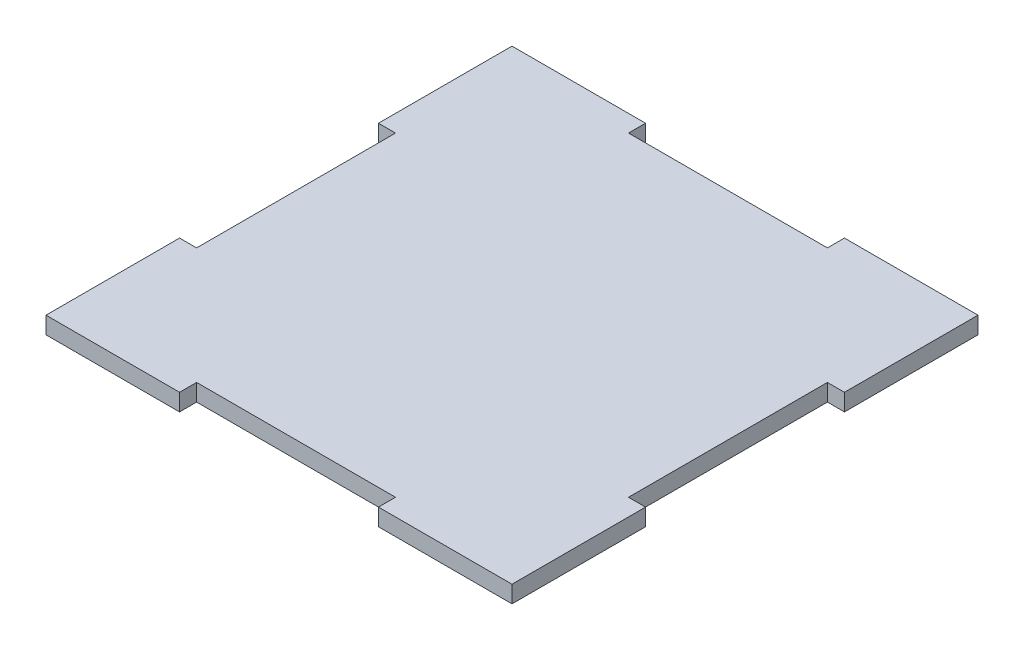
ISO-10303-21;
HEADER;
FILE_DESCRIPTION(('STEP AP214'),'2;1');
FILE_NAME('part.step','',(''),(''),'','','');
FILE_SCHEMA(('AUTOMOTIVE_DESIGN { 1 0 10303 214 1 1 1 1 }'));
ENDSEC;
DATA;
#1=APPLICATION_CONTEXT('core data for automotive mechanical design processes');
#2=APPLICATION_PROTOCOL_DEFINITION('international standard','automotive_design',2000,#1);
#3=PRODUCT_CONTEXT('',#1,'mechanical');
#4=PRODUCT('Part','Part','',(#3));
#5=PRODUCT_RELATED_PRODUCT_CATEGORY('part','',(#4));
#6=PRODUCT_DEFINITION_FORMATION('','',#4);
#7=PRODUCT_DEFINITION_CONTEXT('part definition',#1,'design');
#8=PRODUCT_DEFINITION('design','',#6,#7);
#9=PRODUCT_DEFINITION_SHAPE('','',#8);
#10=(LENGTH_UNIT() NAMED_UNIT(*) SI_UNIT(.MILLI.,.METRE.));
#11=(NAMED_UNIT(*) PLANE_ANGLE_UNIT() SI_UNIT($,.RADIAN.));
#12=(NAMED_UNIT(*) SI_UNIT($,.STERADIAN.) SOLID_ANGLE_UNIT());
#13=UNCERTAINTY_MEASURE_WITH_UNIT(LENGTH_MEASURE(1.E-05),#10,'distance_accuracy_value','');
#14=(GEOMETRIC_REPRESENTATION_CONTEXT(3) GLOBAL_UNCERTAINTY_ASSIGNED_CONTEXT((#13)) GLOBAL_UNIT_ASSIGNED_CONTEXT((#10,
#11,#12)) REPRESENTATION_CONTEXT('',''));
#15=CARTESIAN_POINT('',(0.,0.,0.));
#16=DIRECTION('',(0.,0.,1.));
#17=DIRECTION('',(1.,0.,0.));
#18=AXIS2_PLACEMENT_3D('',#15,#16,#17);
#19=CARTESIAN_POINT('',(41.,3.,-17.5));
#20=DIRECTION('',(-1.,0.,0.));
#21=DIRECTION('',(0.,0.,1.));
#22=AXIS2_PLACEMENT_3D('',#19,#20,#21);
#23=PLANE('',#22);
#24=DIRECTION('',(0.,0.,-1.));
#25=VECTOR('',#24,1.);
#26=CARTESIAN_POINT('',(41.,0.,-17.5));
#27=LINE('',#26,#25);
#28=CARTESIAN_POINT('',(41.,0.,-17.5));
#29=VERTEX_POINT('',#28);
#30=CARTESIAN_POINT('',(41.,0.,-41.));
#31=VERTEX_POINT('',#30);
#32=EDGE_CURVE('E205',#29,#31,#27,.T.);
#33=ORIENTED_EDGE('',*,*,#32,.T.);
#34=DIRECTION('',(0.,-1.,0.));
#35=VECTOR('',#34,1.);
#36=CARTESIAN_POINT('',(41.,3.,-41.));
#37=LINE('',#36,#35);
#38=CARTESIAN_POINT('',(41.,3.,-41.));
#39=VERTEX_POINT('',#38);
#40=EDGE_CURVE('E11',#39,#31,#37,.T.);
#41=ORIENTED_EDGE('',*,*,#40,.F.);
#42=DIRECTION('',(0.,0.,-1.));
#43=VECTOR('',#42,1.);
#44=CARTESIAN_POINT('',(41.,3.,-17.5));
#45=LINE('',#44,#43);
#46=CARTESIAN_POINT('',(41.,3.,-17.5));
#47=VERTEX_POINT('',#46);
#48=EDGE_CURVE('E243',#47,#39,#45,.T.);
#49=ORIENTED_EDGE('',*,*,#48,.F.);
#50=DIRECTION('',(0.,-1.,0.));
#51=VECTOR('',#50,1.);
#52=CARTESIAN_POINT('',(41.,3.,-17.5));
#53=LINE('',#52,#51);
#54=EDGE_CURVE('E201',#47,#29,#53,.T.);
#55=ORIENTED_EDGE('',*,*,#54,.T.);
#56=EDGE_LOOP('',(#33,#41,#49,#55));
#57=FACE_BOUND('',#56,.T.);
#58=ADVANCED_FACE('F37',(#57),#23,.F.);
#59=CARTESIAN_POINT('',(17.5,3.,-41.));
#60=DIRECTION('',(0.,0.,1.));
#61=DIRECTION('',(1.,0.,0.));
#62=AXIS2_PLACEMENT_3D('',#59,#60,#61);
#63=PLANE('',#62);
#64=DIRECTION('',(-1.,0.,0.));
#65=VECTOR('',#64,1.);
#66=CARTESIAN_POINT('',(17.5,0.,-41.));
#67=LINE('',#66,#65);
#68=CARTESIAN_POINT('',(17.5,0.,-41.));
#69=VERTEX_POINT('',#68);
#70=EDGE_CURVE('E208',#31,#69,#67,.T.);
#71=ORIENTED_EDGE('',*,*,#70,.T.);
#72=DIRECTION('',(0.,-1.,0.));
#73=VECTOR('',#72,1.);
#74=CARTESIAN_POINT('',(17.5,3.,-41.));
#75=LINE('',#74,#73);
#76=CARTESIAN_POINT('',(17.5,3.,-41.));
#77=VERTEX_POINT('',#76);
#78=EDGE_CURVE('E45',#77,#69,#75,.T.);
#79=ORIENTED_EDGE('',*,*,#78,.F.);
#80=DIRECTION('',(-1.,0.,0.));
#81=VECTOR('',#80,1.);
#82=CARTESIAN_POINT('',(17.5,3.,-41.));
#83=LINE('',#82,#81);
#84=EDGE_CURVE('E132',#39,#77,#83,.T.);
#85=ORIENTED_EDGE('',*,*,#84,.F.);
#86=ORIENTED_EDGE('',*,*,#40,.T.);
#87=EDGE_LOOP('',(#71,#79,#85,#86));
#88=FACE_BOUND('',#87,.T.);
#89=ADVANCED_FACE('F361',(#88),#63,.F.);
#90=CARTESIAN_POINT('',(17.5,3.,-38.));
#91=DIRECTION('',(1.,0.,0.));
#92=DIRECTION('',(0.,0.,-1.));
#93=AXIS2_PLACEMENT_3D('',#90,#91,#92);
#94=PLANE('',#93);
#95=DIRECTION('',(0.,0.,1.));
#96=VECTOR('',#95,1.);
#97=CARTESIAN_POINT('',(17.5,0.,-38.));
#98=LINE('',#97,#96);
#99=CARTESIAN_POINT('',(17.5,0.,-38.));
#100=VERTEX_POINT('',#99);
#101=EDGE_CURVE('E210',#69,#100,#98,.T.);
#102=ORIENTED_EDGE('',*,*,#101,.T.);
#103=DIRECTION('',(0.,-1.,0.));
#104=VECTOR('',#103,1.);
#105=CARTESIAN_POINT('',(17.5,3.,-38.));
#106=LINE('',#105,#104);
#107=CARTESIAN_POINT('',(17.5,3.,-38.));
#108=VERTEX_POINT('',#107);
#109=EDGE_CURVE('E286',#108,#100,#106,.T.);
#110=ORIENTED_EDGE('',*,*,#109,.F.);
#111=DIRECTION('',(0.,0.,1.));
#112=VECTOR('',#111,1.);
#113=CARTESIAN_POINT('',(17.5,3.,-38.));
#114=LINE('',#113,#112);
#115=EDGE_CURVE('E294',#77,#108,#114,.T.);
#116=ORIENTED_EDGE('',*,*,#115,.F.);
#117=ORIENTED_EDGE('',*,*,#78,.T.);
#118=EDGE_LOOP('',(#102,#110,#116,#117));
#119=FACE_BOUND('',#118,.T.);
#120=ADVANCED_FACE('F292',(#119),#94,.F.);
#121=CARTESIAN_POINT('',(-17.5,3.,-38.));
#122=DIRECTION('',(0.,0.,1.));
#123=DIRECTION('',(1.,0.,0.));
#124=AXIS2_PLACEMENT_3D('',#121,#122,#123);
#125=PLANE('',#124);
#126=DIRECTION('',(-1.,0.,0.));
#127=VECTOR('',#126,1.);
#128=CARTESIAN_POINT('',(-17.5,0.,-38.));
#129=LINE('',#128,#127);
#130=CARTESIAN_POINT('',(-17.5,0.,-38.));
#131=VERTEX_POINT('',#130);
#132=EDGE_CURVE('E212',#100,#131,#129,.T.);
#133=ORIENTED_EDGE('',*,*,#132,.T.);
#134=DIRECTION('',(0.,-1.,0.));
#135=VECTOR('',#134,1.);
#136=CARTESIAN_POINT('',(-17.5,3.,-38.));
#137=LINE('',#136,#135);
#138=CARTESIAN_POINT('',(-17.5,3.,-38.));
#139=VERTEX_POINT('',#138);
#140=EDGE_CURVE('E283',#139,#131,#137,.T.);
#141=ORIENTED_EDGE('',*,*,#140,.F.);
#142=DIRECTION('',(-1.,0.,0.));
#143=VECTOR('',#142,1.);
#144=CARTESIAN_POINT('',(-17.5,3.,-38.));
#145=LINE('',#144,#143);
#146=EDGE_CURVE('E312',#108,#139,#145,.T.);
#147=ORIENTED_EDGE('',*,*,#146,.F.);
#148=ORIENTED_EDGE('',*,*,#109,.T.);
#149=EDGE_LOOP('',(#133,#141,#147,#148));
#150=FACE_BOUND('',#149,.T.);
#151=ADVANCED_FACE('F303',(#150),#125,.F.);
#152=CARTESIAN_POINT('',(-17.5,3.,-41.));
#153=DIRECTION('',(-1.,0.,0.));
#154=DIRECTION('',(0.,0.,1.));
#155=AXIS2_PLACEMENT_3D('',#152,#153,#154);
#156=PLANE('',#155);
#157=DIRECTION('',(0.,0.,-1.));
#158=VECTOR('',#157,1.);
#159=CARTESIAN_POINT('',(-17.5,0.,-41.));
#160=LINE('',#159,#158);
#161=CARTESIAN_POINT('',(-17.5,0.,-41.));
#162=VERTEX_POINT('',#161);
#163=EDGE_CURVE('E214',#131,#162,#160,.T.);
#164=ORIENTED_EDGE('',*,*,#163,.T.);
#165=DIRECTION('',(0.,-1.,0.));
#166=VECTOR('',#165,1.);
#167=CARTESIAN_POINT('',(-17.5,3.,-41.));
#168=LINE('',#167,#166);
#169=CARTESIAN_POINT('',(-17.5,3.,-41.));
#170=VERTEX_POINT('',#169);
#171=EDGE_CURVE('E280',#170,#162,#168,.T.);
#172=ORIENTED_EDGE('',*,*,#171,.F.);
#173=DIRECTION('',(0.,0.,-1.));
#174=VECTOR('',#173,1.);
#175=CARTESIAN_POINT('',(-17.5,3.,-41.));
#176=LINE('',#175,#174);
#177=EDGE_CURVE('E309',#139,#170,#176,.T.);
#178=ORIENTED_EDGE('',*,*,#177,.F.);
#179=ORIENTED_EDGE('',*,*,#140,.T.);
#180=EDGE_LOOP('',(#164,#172,#178,#179));
#181=FACE_BOUND('',#180,.T.);
#182=ADVANCED_FACE('F307',(#181),#156,.F.);
#183=CARTESIAN_POINT('',(-41.,3.,-41.));
#184=DIRECTION('',(0.,0.,1.));
#185=DIRECTION('',(1.,0.,0.));
#186=AXIS2_PLACEMENT_3D('',#183,#184,#185);
#187=PLANE('',#186);
#188=DIRECTION('',(-1.,0.,0.));
#189=VECTOR('',#188,1.);
#190=CARTESIAN_POINT('',(-41.,0.,-41.));
#191=LINE('',#190,#189);
#192=CARTESIAN_POINT('',(-41.,0.,-41.));
#193=VERTEX_POINT('',#192);
#194=EDGE_CURVE('E216',#162,#193,#191,.T.);
#195=ORIENTED_EDGE('',*,*,#194,.T.);
#196=DIRECTION('',(0.,-1.,0.));
#197=VECTOR('',#196,1.);
#198=CARTESIAN_POINT('',(-41.,3.,-41.));
#199=LINE('',#198,#197);
#200=CARTESIAN_POINT('',(-41.,3.,-41.));
#201=VERTEX_POINT('',#200);
#202=EDGE_CURVE('E277',#201,#193,#199,.T.);
#203=ORIENTED_EDGE('',*,*,#202,.F.);
#204=DIRECTION('',(-1.,0.,0.));
#205=VECTOR('',#204,1.);
#206=CARTESIAN_POINT('',(-41.,3.,-41.));
#207=LINE('',#206,#205);
#208=EDGE_CURVE('E311',#170,#201,#207,.T.);
#209=ORIENTED_EDGE('',*,*,#208,.F.);
#210=ORIENTED_EDGE('',*,*,#171,.T.);
#211=EDGE_LOOP('',(#195,#203,#209,#210));
#212=FACE_BOUND('',#211,.T.);
#213=ADVANCED_FACE('F374',(#212),#187,.F.);
#214=CARTESIAN_POINT('',(-41.,3.,-17.5));
#215=DIRECTION('',(1.,0.,0.));
#216=DIRECTION('',(0.,0.,-1.));
#217=AXIS2_PLACEMENT_3D('',#214,#215,#216);
#218=PLANE('',#217);
#219=DIRECTION('',(0.,0.,1.));
#220=VECTOR('',#219,1.);
#221=CARTESIAN_POINT('',(-41.,0.,-17.5));
#222=LINE('',#221,#220);
#223=CARTESIAN_POINT('',(-41.,0.,-17.5));
#224=VERTEX_POINT('',#223);
#225=EDGE_CURVE('E218',#193,#224,#222,.T.);
#226=ORIENTED_EDGE('',*,*,#225,.T.);
#227=DIRECTION('',(0.,-1.,0.));
#228=VECTOR('',#227,1.);
#229=CARTESIAN_POINT('',(-41.,3.,-17.5));
#230=LINE('',#229,#228);
#231=CARTESIAN_POINT('',(-41.,3.,-17.5));
#232=VERTEX_POINT('',#231);
#233=EDGE_CURVE('E274',#232,#224,#230,.T.);
#234=ORIENTED_EDGE('',*,*,#233,.F.);
#235=DIRECTION('',(0.,0.,1.));
#236=VECTOR('',#235,1.);
#237=CARTESIAN_POINT('',(-41.,3.,-17.5));
#238=LINE('',#237,#236);
#239=EDGE_CURVE('E314',#201,#232,#238,.T.);
#240=ORIENTED_EDGE('',*,*,#239,.F.);
#241=ORIENTED_EDGE('',*,*,#202,.T.);
#242=EDGE_LOOP('',(#226,#234,#240,#241));
#243=FACE_BOUND('',#242,.T.);
#244=ADVANCED_FACE('F377',(#243),#218,.F.);
#245=CARTESIAN_POINT('',(-41.,3.,-17.5));
#246=DIRECTION('',(0.,0.,-1.));
#247=DIRECTION('',(-1.,0.,0.));
#248=AXIS2_PLACEMENT_3D('',#245,#246,#247);
#249=PLANE('',#248);
#250=DIRECTION('',(1.,0.,0.));
#251=VECTOR('',#250,1.);
#252=CARTESIAN_POINT('',(-41.,0.,-17.5));
#253=LINE('',#252,#251);
#254=CARTESIAN_POINT('',(-38.,0.,-17.5));
#255=VERTEX_POINT('',#254);
#256=EDGE_CURVE('E220',#224,#255,#253,.T.);
#257=ORIENTED_EDGE('',*,*,#256,.T.);
#258=DIRECTION('',(0.,-1.,0.));
#259=VECTOR('',#258,1.);
#260=CARTESIAN_POINT('',(-38.,3.,-17.5));
#261=LINE('',#260,#259);
#262=CARTESIAN_POINT('',(-38.,3.,-17.5));
#263=VERTEX_POINT('',#262);
#264=EDGE_CURVE('E271',#263,#255,#261,.T.);
#265=ORIENTED_EDGE('',*,*,#264,.F.);
#266=DIRECTION('',(1.,0.,0.));
#267=VECTOR('',#266,1.);
#268=CARTESIAN_POINT('',(-41.,3.,-17.5));
#269=LINE('',#268,#267);
#270=EDGE_CURVE('E320',#232,#263,#269,.T.);
#271=ORIENTED_EDGE('',*,*,#270,.F.);
#272=ORIENTED_EDGE('',*,*,#233,.T.);
#273=EDGE_LOOP('',(#257,#265,#271,#272));
#274=FACE_BOUND('',#273,.T.);
#275=ADVANCED_FACE('F381',(#274),#249,.F.);
#276=CARTESIAN_POINT('',(-38.,3.,-17.5));
#277=DIRECTION('',(1.,0.,0.));
#278=DIRECTION('',(0.,0.,-1.));
#279=AXIS2_PLACEMENT_3D('',#276,#277,#278);
#280=PLANE('',#279);
#281=DIRECTION('',(0.,0.,1.));
#282=VECTOR('',#281,1.);
#283=CARTESIAN_POINT('',(-38.,0.,-17.5));
#284=LINE('',#283,#282);
#285=CARTESIAN_POINT('',(-38.,0.,17.5));
#286=VERTEX_POINT('',#285);
#287=EDGE_CURVE('E222',#255,#286,#284,.T.);
#288=ORIENTED_EDGE('',*,*,#287,.T.);
#289=DIRECTION('',(0.,-1.,0.));
#290=VECTOR('',#289,1.);
#291=CARTESIAN_POINT('',(-38.,3.,17.5));
#292=LINE('',#291,#290);
#293=CARTESIAN_POINT('',(-38.,3.,17.5));
#294=VERTEX_POINT('',#293);
#295=EDGE_CURVE('E268',#294,#286,#292,.T.);
#296=ORIENTED_EDGE('',*,*,#295,.F.);
#297=DIRECTION('',(0.,0.,1.));
#298=VECTOR('',#297,1.);
#299=CARTESIAN_POINT('',(-38.,3.,-17.5));
#300=LINE('',#299,#298);
#301=EDGE_CURVE('E322',#263,#294,#300,.T.);
#302=ORIENTED_EDGE('',*,*,#301,.F.);
#303=ORIENTED_EDGE('',*,*,#264,.T.);
#304=EDGE_LOOP('',(#288,#296,#302,#303));
#305=FACE_BOUND('',#304,.T.);
#306=ADVANCED_FACE('F385',(#305),#280,.F.);
#307=CARTESIAN_POINT('',(-38.,3.,17.5));
#308=DIRECTION('',(0.,0.,1.));
#309=DIRECTION('',(1.,0.,0.));
#310=AXIS2_PLACEMENT_3D('',#307,#308,#309);
#311=PLANE('',#310);
#312=DIRECTION('',(-1.,0.,0.));
#313=VECTOR('',#312,1.);
#314=CARTESIAN_POINT('',(-38.,0.,17.5));
#315=LINE('',#314,#313);
#316=CARTESIAN_POINT('',(-41.,0.,17.5));
#317=VERTEX_POINT('',#316);
#318=EDGE_CURVE('E224',#286,#317,#315,.T.);
#319=ORIENTED_EDGE('',*,*,#318,.T.);
#320=DIRECTION('',(0.,-1.,0.));
#321=VECTOR('',#320,1.);
#322=CARTESIAN_POINT('',(-41.,3.,17.5));
#323=LINE('',#322,#321);
#324=CARTESIAN_POINT('',(-41.,3.,17.5));
#325=VERTEX_POINT('',#324);
#326=EDGE_CURVE('E265',#325,#317,#323,.T.);
#327=ORIENTED_EDGE('',*,*,#326,.F.);
#328=DIRECTION('',(-1.,0.,0.));
#329=VECTOR('',#328,1.);
#330=CARTESIAN_POINT('',(-38.,3.,17.5));
#331=LINE('',#330,#329);
#332=EDGE_CURVE('E324',#294,#325,#331,.T.);
#333=ORIENTED_EDGE('',*,*,#332,.F.);
#334=ORIENTED_EDGE('',*,*,#295,.T.);
#335=EDGE_LOOP('',(#319,#327,#333,#334));
#336=FACE_BOUND('',#335,.T.);
#337=ADVANCED_FACE('F389',(#336),#311,.F.);
#338=CARTESIAN_POINT('',(-41.,3.,41.));
#339=DIRECTION('',(1.,0.,0.));
#340=DIRECTION('',(0.,0.,-1.));
#341=AXIS2_PLACEMENT_3D('',#338,#339,#340);
#342=PLANE('',#341);
#343=DIRECTION('',(0.,0.,1.));
#344=VECTOR('',#343,1.);
#345=CARTESIAN_POINT('',(-41.,0.,41.));
#346=LINE('',#345,#344);
#347=CARTESIAN_POINT('',(-41.,0.,41.));
#348=VERTEX_POINT('',#347);
#349=EDGE_CURVE('E226',#317,#348,#346,.T.);
#350=ORIENTED_EDGE('',*,*,#349,.T.);
#351=DIRECTION('',(0.,-1.,0.));
#352=VECTOR('',#351,1.);
#353=CARTESIAN_POINT('',(-41.,3.,41.));
#354=LINE('',#353,#352);
#355=CARTESIAN_POINT('',(-41.,3.,41.));
#356=VERTEX_POINT('',#355);
#357=EDGE_CURVE('E262',#356,#348,#354,.T.);
#358=ORIENTED_EDGE('',*,*,#357,.F.);
#359=DIRECTION('',(0.,0.,1.));
#360=VECTOR('',#359,1.);
#361=CARTESIAN_POINT('',(-41.,3.,41.));
#362=LINE('',#361,#360);
#363=EDGE_CURVE('E326',#325,#356,#362,.T.);
#364=ORIENTED_EDGE('',*,*,#363,.F.);
#365=ORIENTED_EDGE('',*,*,#326,.T.);
#366=EDGE_LOOP('',(#350,#358,#364,#365));
#367=FACE_BOUND('',#366,.T.);
#368=ADVANCED_FACE('F393',(#367),#342,.F.);
#369=CARTESIAN_POINT('',(-41.,3.,41.));
#370=DIRECTION('',(0.,0.,-1.));
#371=DIRECTION('',(-1.,0.,0.));
#372=AXIS2_PLACEMENT_3D('',#369,#370,#371);
#373=PLANE('',#372);
#374=DIRECTION('',(1.,0.,0.));
#375=VECTOR('',#374,1.);
#376=CARTESIAN_POINT('',(-41.,0.,41.));
#377=LINE('',#376,#375);
#378=CARTESIAN_POINT('',(-17.5,0.,41.));
#379=VERTEX_POINT('',#378);
#380=EDGE_CURVE('E228',#348,#379,#377,.T.);
#381=ORIENTED_EDGE('',*,*,#380,.T.);
#382=DIRECTION('',(0.,-1.,0.));
#383=VECTOR('',#382,1.);
#384=CARTESIAN_POINT('',(-17.5,3.,41.));
#385=LINE('',#384,#383);
#386=CARTESIAN_POINT('',(-17.5,3.,41.));
#387=VERTEX_POINT('',#386);
#388=EDGE_CURVE('E259',#387,#379,#385,.T.);
#389=ORIENTED_EDGE('',*,*,#388,.F.);
#390=DIRECTION('',(1.,0.,0.));
#391=VECTOR('',#390,1.);
#392=CARTESIAN_POINT('',(-41.,3.,41.));
#393=LINE('',#392,#391);
#394=EDGE_CURVE('E328',#356,#387,#393,.T.);
#395=ORIENTED_EDGE('',*,*,#394,.F.);
#396=ORIENTED_EDGE('',*,*,#357,.T.);
#397=EDGE_LOOP('',(#381,#389,#395,#396));
#398=FACE_BOUND('',#397,.T.);
#399=ADVANCED_FACE('F397',(#398),#373,.F.);
#400=CARTESIAN_POINT('',(-17.5,3.,38.));
#401=DIRECTION('',(-1.,0.,0.));
#402=DIRECTION('',(0.,0.,1.));
#403=AXIS2_PLACEMENT_3D('',#400,#401,#402);
#404=PLANE('',#403);
#405=DIRECTION('',(0.,0.,-1.));
#406=VECTOR('',#405,1.);
#407=CARTESIAN_POINT('',(-17.5,0.,38.));
#408=LINE('',#407,#406);
#409=CARTESIAN_POINT('',(-17.5,0.,38.));
#410=VERTEX_POINT('',#409);
#411=EDGE_CURVE('E230',#379,#410,#408,.T.);
#412=ORIENTED_EDGE('',*,*,#411,.T.);
#413=DIRECTION('',(0.,-1.,0.));
#414=VECTOR('',#413,1.);
#415=CARTESIAN_POINT('',(-17.5,3.,38.));
#416=LINE('',#415,#414);
#417=CARTESIAN_POINT('',(-17.5,3.,38.));
#418=VERTEX_POINT('',#417);
#419=EDGE_CURVE('E256',#418,#410,#416,.T.);
#420=ORIENTED_EDGE('',*,*,#419,.F.);
#421=DIRECTION('',(0.,0.,-1.));
#422=VECTOR('',#421,1.);
#423=CARTESIAN_POINT('',(-17.5,3.,38.));
#424=LINE('',#423,#422);
#425=EDGE_CURVE('E330',#387,#418,#424,.T.);
#426=ORIENTED_EDGE('',*,*,#425,.F.);
#427=ORIENTED_EDGE('',*,*,#388,.T.);
#428=EDGE_LOOP('',(#412,#420,#426,#427));
#429=FACE_BOUND('',#428,.T.);
#430=ADVANCED_FACE('F401',(#429),#404,.F.);
#431=CARTESIAN_POINT('',(17.5,3.,38.));
#432=DIRECTION('',(0.,0.,-1.));
#433=DIRECTION('',(-1.,0.,0.));
#434=AXIS2_PLACEMENT_3D('',#431,#432,#433);
#435=PLANE('',#434);
#436=DIRECTION('',(1.,0.,0.));
#437=VECTOR('',#436,1.);
#438=CARTESIAN_POINT('',(17.5,0.,38.));
#439=LINE('',#438,#437);
#440=CARTESIAN_POINT('',(17.5,0.,38.));
#441=VERTEX_POINT('',#440);
#442=EDGE_CURVE('E232',#410,#441,#439,.T.);
#443=ORIENTED_EDGE('',*,*,#442,.T.);
#444=DIRECTION('',(0.,-1.,0.));
#445=VECTOR('',#444,1.);
#446=CARTESIAN_POINT('',(17.5,3.,38.));
#447=LINE('',#446,#445);
#448=CARTESIAN_POINT('',(17.5,3.,38.));
#449=VERTEX_POINT('',#448);
#450=EDGE_CURVE('E253',#449,#441,#447,.T.);
#451=ORIENTED_EDGE('',*,*,#450,.F.);
#452=DIRECTION('',(1.,0.,0.));
#453=VECTOR('',#452,1.);
#454=CARTESIAN_POINT('',(17.5,3.,38.));
#455=LINE('',#454,#453);
#456=EDGE_CURVE('E332',#418,#449,#455,.T.);
#457=ORIENTED_EDGE('',*,*,#456,.F.);
#458=ORIENTED_EDGE('',*,*,#419,.T.);
#459=EDGE_LOOP('',(#443,#451,#457,#458));
#460=FACE_BOUND('',#459,.T.);
#461=ADVANCED_FACE('F405',(#460),#435,.F.);
#462=CARTESIAN_POINT('',(17.5,3.,41.));
#463=DIRECTION('',(1.,0.,0.));
#464=DIRECTION('',(0.,0.,-1.));
#465=AXIS2_PLACEMENT_3D('',#462,#463,#464);
#466=PLANE('',#465);
#467=DIRECTION('',(0.,0.,1.));
#468=VECTOR('',#467,1.);
#469=CARTESIAN_POINT('',(17.5,0.,41.));
#470=LINE('',#469,#468);
#471=CARTESIAN_POINT('',(17.5,0.,41.));
#472=VERTEX_POINT('',#471);
#473=EDGE_CURVE('E234',#441,#472,#470,.T.);
#474=ORIENTED_EDGE('',*,*,#473,.T.);
#475=DIRECTION('',(0.,-1.,0.));
#476=VECTOR('',#475,1.);
#477=CARTESIAN_POINT('',(17.5,3.,41.));
#478=LINE('',#477,#476);
#479=CARTESIAN_POINT('',(17.5,3.,41.));
#480=VERTEX_POINT('',#479);
#481=EDGE_CURVE('E250',#480,#472,#478,.T.);
#482=ORIENTED_EDGE('',*,*,#481,.F.);
#483=DIRECTION('',(0.,0.,1.));
#484=VECTOR('',#483,1.);
#485=CARTESIAN_POINT('',(17.5,3.,41.));
#486=LINE('',#485,#484);
#487=EDGE_CURVE('E334',#449,#480,#486,.T.);
#488=ORIENTED_EDGE('',*,*,#487,.F.);
#489=ORIENTED_EDGE('',*,*,#450,.T.);
#490=EDGE_LOOP('',(#474,#482,#488,#489));
#491=FACE_BOUND('',#490,.T.);
#492=ADVANCED_FACE('F409',(#491),#466,.F.);
#493=CARTESIAN_POINT('',(17.5,3.,41.));
#494=DIRECTION('',(0.,0.,-1.));
#495=DIRECTION('',(-1.,0.,0.));
#496=AXIS2_PLACEMENT_3D('',#493,#494,#495);
#497=PLANE('',#496);
#498=DIRECTION('',(1.,0.,0.));
#499=VECTOR('',#498,1.);
#500=CARTESIAN_POINT('',(17.5,0.,41.));
#501=LINE('',#500,#499);
#502=CARTESIAN_POINT('',(41.,0.,41.));
#503=VERTEX_POINT('',#502);
#504=EDGE_CURVE('E236',#472,#503,#501,.T.);
#505=ORIENTED_EDGE('',*,*,#504,.T.);
#506=DIRECTION('',(0.,-1.,0.));
#507=VECTOR('',#506,1.);
#508=CARTESIAN_POINT('',(41.,3.,41.));
#509=LINE('',#508,#507);
#510=CARTESIAN_POINT('',(41.,3.,41.));
#511=VERTEX_POINT('',#510);
#512=EDGE_CURVE('E247',#511,#503,#509,.T.);
#513=ORIENTED_EDGE('',*,*,#512,.F.);
#514=DIRECTION('',(1.,0.,0.));
#515=VECTOR('',#514,1.);
#516=CARTESIAN_POINT('',(17.5,3.,41.));
#517=LINE('',#516,#515);
#518=EDGE_CURVE('E336',#480,#511,#517,.T.);
#519=ORIENTED_EDGE('',*,*,#518,.F.);
#520=ORIENTED_EDGE('',*,*,#481,.T.);
#521=EDGE_LOOP('',(#505,#513,#519,#520));
#522=FACE_BOUND('',#521,.T.);
#523=ADVANCED_FACE('F342',(#522),#497,.F.);
#524=CARTESIAN_POINT('',(41.,3.,41.));
#525=DIRECTION('',(-1.,0.,0.));
#526=DIRECTION('',(0.,0.,1.));
#527=AXIS2_PLACEMENT_3D('',#524,#525,#526);
#528=PLANE('',#527);
#529=DIRECTION('',(0.,0.,-1.));
#530=VECTOR('',#529,1.);
#531=CARTESIAN_POINT('',(41.,0.,41.));
#532=LINE('',#531,#530);
#533=CARTESIAN_POINT('',(41.,0.,17.5));
#534=VERTEX_POINT('',#533);
#535=EDGE_CURVE('E238',#503,#534,#532,.T.);
#536=ORIENTED_EDGE('',*,*,#535,.T.);
#537=DIRECTION('',(0.,-1.,0.));
#538=VECTOR('',#537,1.);
#539=CARTESIAN_POINT('',(41.,3.,17.5));
#540=LINE('',#539,#538);
#541=CARTESIAN_POINT('',(41.,3.,17.5));
#542=VERTEX_POINT('',#541);
#543=EDGE_CURVE('E196',#542,#534,#540,.T.);
#544=ORIENTED_EDGE('',*,*,#543,.F.);
#545=DIRECTION('',(0.,0.,-1.));
#546=VECTOR('',#545,1.);
#547=CARTESIAN_POINT('',(41.,3.,41.));
#548=LINE('',#547,#546);
#549=EDGE_CURVE('E187',#511,#542,#548,.T.);
#550=ORIENTED_EDGE('',*,*,#549,.F.);
#551=ORIENTED_EDGE('',*,*,#512,.T.);
#552=EDGE_LOOP('',(#536,#544,#550,#551));
#553=FACE_BOUND('',#552,.T.);
#554=ADVANCED_FACE('F346',(#553),#528,.F.);
#555=CARTESIAN_POINT('',(38.,3.,17.5));
#556=DIRECTION('',(0.,0.,1.));
#557=DIRECTION('',(1.,0.,0.));
#558=AXIS2_PLACEMENT_3D('',#555,#556,#557);
#559=PLANE('',#558);
#560=DIRECTION('',(-1.,0.,0.));
#561=VECTOR('',#560,1.);
#562=CARTESIAN_POINT('',(38.,0.,17.5));
#563=LINE('',#562,#561);
#564=CARTESIAN_POINT('',(38.,0.,17.5));
#565=VERTEX_POINT('',#564);
#566=EDGE_CURVE('E195',#534,#565,#563,.T.);
#567=ORIENTED_EDGE('',*,*,#566,.T.);
#568=DIRECTION('',(0.,-1.,0.));
#569=VECTOR('',#568,1.);
#570=CARTESIAN_POINT('',(38.,3.,17.5));
#571=LINE('',#570,#569);
#572=CARTESIAN_POINT('',(38.,3.,17.5));
#573=VERTEX_POINT('',#572);
#574=EDGE_CURVE('E192',#573,#565,#571,.T.);
#575=ORIENTED_EDGE('',*,*,#574,.F.);
#576=DIRECTION('',(-1.,0.,0.));
#577=VECTOR('',#576,1.);
#578=CARTESIAN_POINT('',(38.,3.,17.5));
#579=LINE('',#578,#577);
#580=EDGE_CURVE('E181',#542,#573,#579,.T.);
#581=ORIENTED_EDGE('',*,*,#580,.F.);
#582=ORIENTED_EDGE('',*,*,#543,.T.);
#583=EDGE_LOOP('',(#567,#575,#581,#582));
#584=FACE_BOUND('',#583,.T.);
#585=ADVANCED_FACE('F193',(#584),#559,.F.);
#586=CARTESIAN_POINT('',(38.,3.,-17.5));
#587=DIRECTION('',(-1.,0.,0.));
#588=DIRECTION('',(0.,0.,1.));
#589=AXIS2_PLACEMENT_3D('',#586,#587,#588);
#590=PLANE('',#589);
#591=DIRECTION('',(0.,0.,-1.));
#592=VECTOR('',#591,1.);
#593=CARTESIAN_POINT('',(38.,0.,-17.5));
#594=LINE('',#593,#592);
#595=CARTESIAN_POINT('',(38.,0.,-17.5));
#596=VERTEX_POINT('',#595);
#597=EDGE_CURVE('E118',#565,#596,#594,.T.);
#598=ORIENTED_EDGE('',*,*,#597,.T.);
#599=DIRECTION('',(0.,-1.,0.));
#600=VECTOR('',#599,1.);
#601=CARTESIAN_POINT('',(38.,3.,-17.5));
#602=LINE('',#601,#600);
#603=CARTESIAN_POINT('',(38.,3.,-17.5));
#604=VERTEX_POINT('',#603);
#605=EDGE_CURVE('E197',#604,#596,#602,.T.);
#606=ORIENTED_EDGE('',*,*,#605,.F.);
#607=DIRECTION('',(0.,0.,-1.));
#608=VECTOR('',#607,1.);
#609=CARTESIAN_POINT('',(38.,3.,-17.5));
#610=LINE('',#609,#608);
#611=EDGE_CURVE('E185',#573,#604,#610,.T.);
#612=ORIENTED_EDGE('',*,*,#611,.F.);
#613=ORIENTED_EDGE('',*,*,#574,.T.);
#614=EDGE_LOOP('',(#598,#606,#612,#613));
#615=FACE_BOUND('',#614,.T.);
#616=ADVANCED_FACE('F199',(#615),#590,.F.);
#617=CARTESIAN_POINT('',(41.,3.,-17.5));
#618=DIRECTION('',(0.,0.,-1.));
#619=DIRECTION('',(-1.,0.,0.));
#620=AXIS2_PLACEMENT_3D('',#617,#618,#619);
#621=PLANE('',#620);
#622=DIRECTION('',(1.,0.,0.));
#623=VECTOR('',#622,1.);
#624=CARTESIAN_POINT('',(41.,0.,-17.5));
#625=LINE('',#624,#623);
#626=EDGE_CURVE('E124',#596,#29,#625,.T.);
#627=ORIENTED_EDGE('',*,*,#626,.T.);
#628=ORIENTED_EDGE('',*,*,#54,.F.);
#629=DIRECTION('',(1.,0.,0.));
#630=VECTOR('',#629,1.);
#631=CARTESIAN_POINT('',(41.,3.,-17.5));
#632=LINE('',#631,#630);
#633=EDGE_CURVE('E53',#604,#47,#632,.T.);
#634=ORIENTED_EDGE('',*,*,#633,.F.);
#635=ORIENTED_EDGE('',*,*,#605,.T.);
#636=EDGE_LOOP('',(#627,#628,#634,#635));
#637=FACE_BOUND('',#636,.T.);
#638=ADVANCED_FACE('F350',(#637),#621,.F.);
#639=CARTESIAN_POINT('',(0.,3.,0.));
#640=DIRECTION('',(0.,-1.,0.));
#641=DIRECTION('',(0.,0.,-1.));
#642=AXIS2_PLACEMENT_3D('',#639,#640,#641);
#643=PLANE('',#642);
#644=ORIENTED_EDGE('',*,*,#48,.T.);
#645=ORIENTED_EDGE('',*,*,#84,.T.);
#646=ORIENTED_EDGE('',*,*,#115,.T.);
#647=ORIENTED_EDGE('',*,*,#146,.T.);
#648=ORIENTED_EDGE('',*,*,#177,.T.);
#649=ORIENTED_EDGE('',*,*,#208,.T.);
#650=ORIENTED_EDGE('',*,*,#239,.T.);
#651=ORIENTED_EDGE('',*,*,#270,.T.);
#652=ORIENTED_EDGE('',*,*,#301,.T.);
#653=ORIENTED_EDGE('',*,*,#332,.T.);
#654=ORIENTED_EDGE('',*,*,#363,.T.);
#655=ORIENTED_EDGE('',*,*,#394,.T.);
#656=ORIENTED_EDGE('',*,*,#425,.T.);
#657=ORIENTED_EDGE('',*,*,#456,.T.);
#658=ORIENTED_EDGE('',*,*,#487,.T.);
#659=ORIENTED_EDGE('',*,*,#518,.T.);
#660=ORIENTED_EDGE('',*,*,#549,.T.);
#661=ORIENTED_EDGE('',*,*,#580,.T.);
#662=ORIENTED_EDGE('',*,*,#611,.T.);
#663=ORIENTED_EDGE('',*,*,#633,.T.);
#664=EDGE_LOOP('',(#644,#645,#646,#647,#648,#649,#650,#651,#652,#653,#654,#655,#656,#657,#658,
#659,#660,#661,#662,#663));
#665=FACE_BOUND('',#664,.T.);
#666=ADVANCED_FACE('F183',(#665),#643,.F.);
#667=CARTESIAN_POINT('',(0.,0.,0.));
#668=DIRECTION('',(0.,-1.,0.));
#669=DIRECTION('',(0.,0.,-1.));
#670=AXIS2_PLACEMENT_3D('',#667,#668,#669);
#671=PLANE('',#670);
#672=ORIENTED_EDGE('',*,*,#32,.F.);
#673=ORIENTED_EDGE('',*,*,#626,.F.);
#674=ORIENTED_EDGE('',*,*,#597,.F.);
#675=ORIENTED_EDGE('',*,*,#566,.F.);
#676=ORIENTED_EDGE('',*,*,#535,.F.);
#677=ORIENTED_EDGE('',*,*,#504,.F.);
#678=ORIENTED_EDGE('',*,*,#473,.F.);
#679=ORIENTED_EDGE('',*,*,#442,.F.);
#680=ORIENTED_EDGE('',*,*,#411,.F.);
#681=ORIENTED_EDGE('',*,*,#380,.F.);
#682=ORIENTED_EDGE('',*,*,#349,.F.);
#683=ORIENTED_EDGE('',*,*,#318,.F.);
#684=ORIENTED_EDGE('',*,*,#287,.F.);
#685=ORIENTED_EDGE('',*,*,#256,.F.);
#686=ORIENTED_EDGE('',*,*,#225,.F.);
#687=ORIENTED_EDGE('',*,*,#194,.F.);
#688=ORIENTED_EDGE('',*,*,#163,.F.);
#689=ORIENTED_EDGE('',*,*,#132,.F.);
#690=ORIENTED_EDGE('',*,*,#101,.F.);
#691=ORIENTED_EDGE('',*,*,#70,.F.);
#692=EDGE_LOOP('',(#672,#673,#674,#675,#676,#677,#678,#679,#680,#681,#682,#683,#684,#685,#686,
#687,#688,#689,#690,#691));
#693=FACE_BOUND('',#692,.T.);
#694=ADVANCED_FACE('F298',(#693),#671,.T.);
#695=CLOSED_SHELL('',(#58,#89,#120,#151,#182,#213,#244,#275,#306,#337,#368,#399,#430,#461,#492,
#523,#554,#585,#616,#638,#666,#694));
#696=MANIFOLD_SOLID_BREP('B2',#695);
#697=ADVANCED_BREP_SHAPE_REPRESENTATION('',(#18,#696),#14);
#698=SHAPE_DEFINITION_REPRESENTATION(#9,#697);
ENDSEC;
END-ISO-10303-21;
